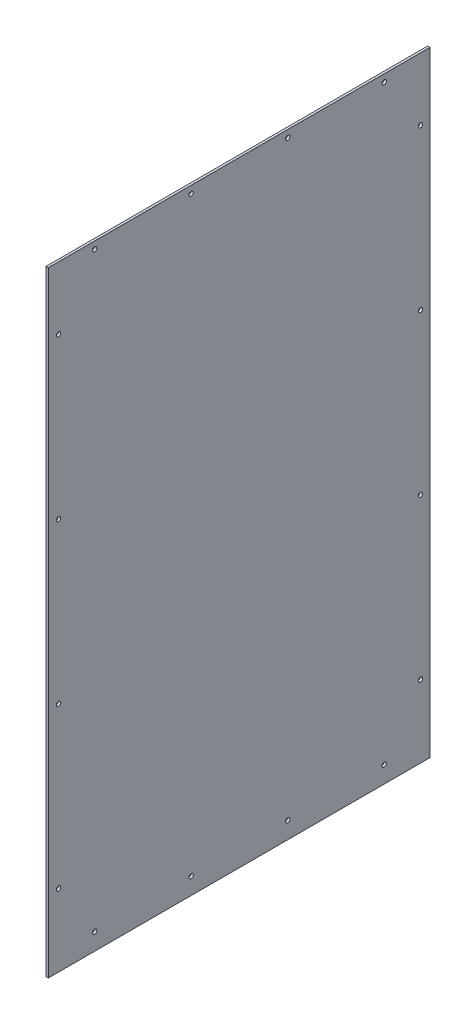
ISO-10303-21;
HEADER;
FILE_DESCRIPTION(('STEP AP214'),'2;1');
FILE_NAME('part.step','',(''),(''),'','','');
FILE_SCHEMA(('AUTOMOTIVE_DESIGN { 1 0 10303 214 1 1 1 1 }'));
ENDSEC;
DATA;
#1=APPLICATION_CONTEXT('core data for automotive mechanical design processes');
#2=APPLICATION_PROTOCOL_DEFINITION('international standard','automotive_design',2000,#1);
#3=PRODUCT_CONTEXT('',#1,'mechanical');
#4=PRODUCT('Part','Part','',(#3));
#5=PRODUCT_RELATED_PRODUCT_CATEGORY('part','',(#4));
#6=PRODUCT_DEFINITION_FORMATION('','',#4);
#7=PRODUCT_DEFINITION_CONTEXT('part definition',#1,'design');
#8=PRODUCT_DEFINITION('design','',#6,#7);
#9=PRODUCT_DEFINITION_SHAPE('','',#8);
#10=(LENGTH_UNIT() NAMED_UNIT(*) SI_UNIT(.MILLI.,.METRE.));
#11=(NAMED_UNIT(*) PLANE_ANGLE_UNIT() SI_UNIT($,.RADIAN.));
#12=(NAMED_UNIT(*) SI_UNIT($,.STERADIAN.) SOLID_ANGLE_UNIT());
#13=UNCERTAINTY_MEASURE_WITH_UNIT(LENGTH_MEASURE(1.E-05),#10,'distance_accuracy_value','');
#14=(GEOMETRIC_REPRESENTATION_CONTEXT(3) GLOBAL_UNCERTAINTY_ASSIGNED_CONTEXT((#13)) GLOBAL_UNIT_ASSIGNED_CONTEXT((#10,
#11,#12)) REPRESENTATION_CONTEXT('',''));
#15=CARTESIAN_POINT('',(0.,0.,0.));
#16=DIRECTION('',(0.,0.,1.));
#17=DIRECTION('',(1.,0.,0.));
#18=AXIS2_PLACEMENT_3D('',#15,#16,#17);
#19=CARTESIAN_POINT('',(0.,-309.5117,237.8583));
#20=DIRECTION('',(1.,0.,0.));
#21=DIRECTION('',(0.,0.,-1.));
#22=AXIS2_PLACEMENT_3D('',#19,#20,#21);
#23=CYLINDRICAL_SURFACE('',#22,2.8956);
#24=CARTESIAN_POINT('',(0.,-309.5117,237.8583));
#25=DIRECTION('',(1.,0.,0.));
#26=DIRECTION('',(0.,0.,-1.));
#27=AXIS2_PLACEMENT_3D('',#24,#25,#26);
#28=CIRCLE('',#27,2.8956);
#29=CARTESIAN_POINT('',(0.,-309.5117,234.9627));
#30=VERTEX_POINT('',#29);
#31=EDGE_CURVE('E40',#30,#30,#28,.T.);
#32=ORIENTED_EDGE('',*,*,#31,.F.);
#33=EDGE_LOOP('',(#32));
#34=FACE_BOUND('',#33,.T.);
#35=CARTESIAN_POINT('',(3.0734,-309.5117,237.8583));
#36=DIRECTION('',(1.,0.,0.));
#37=DIRECTION('',(0.,0.,-1.));
#38=AXIS2_PLACEMENT_3D('',#35,#36,#37);
#39=CIRCLE('',#38,2.8956);
#40=CARTESIAN_POINT('',(3.0734,-309.5117,234.9627));
#41=VERTEX_POINT('',#40);
#42=EDGE_CURVE('E11',#41,#41,#39,.T.);
#43=ORIENTED_EDGE('',*,*,#42,.T.);
#44=EDGE_LOOP('',(#43));
#45=FACE_BOUND('',#44,.T.);
#46=ADVANCED_FACE('F33',(#34,#45),#23,.F.);
#47=CARTESIAN_POINT('',(0.,-98.9372333333335,237.8583));
#48=DIRECTION('',(1.,0.,0.));
#49=DIRECTION('',(0.,0.,-1.));
#50=AXIS2_PLACEMENT_3D('',#47,#48,#49);
#51=CYLINDRICAL_SURFACE('',#50,2.8956);
#52=CARTESIAN_POINT('',(0.,-98.9372333333335,237.8583));
#53=DIRECTION('',(1.,0.,0.));
#54=DIRECTION('',(0.,0.,-1.));
#55=AXIS2_PLACEMENT_3D('',#52,#53,#54);
#56=CIRCLE('',#55,2.8956);
#57=CARTESIAN_POINT('',(0.,-98.9372333333335,234.9627));
#58=VERTEX_POINT('',#57);
#59=EDGE_CURVE('E294',#58,#58,#56,.T.);
#60=ORIENTED_EDGE('',*,*,#59,.F.);
#61=EDGE_LOOP('',(#60));
#62=FACE_BOUND('',#61,.T.);
#63=CARTESIAN_POINT('',(3.0734,-98.9372333333335,237.8583));
#64=DIRECTION('',(1.,0.,0.));
#65=DIRECTION('',(0.,0.,-1.));
#66=AXIS2_PLACEMENT_3D('',#63,#64,#65);
#67=CIRCLE('',#66,2.8956);
#68=CARTESIAN_POINT('',(3.0734,-98.9372333333335,234.9627));
#69=VERTEX_POINT('',#68);
#70=EDGE_CURVE('E297',#69,#69,#67,.T.);
#71=ORIENTED_EDGE('',*,*,#70,.T.);
#72=EDGE_LOOP('',(#71));
#73=FACE_BOUND('',#72,.T.);
#74=ADVANCED_FACE('F306',(#62,#73),#51,.F.);
#75=CARTESIAN_POINT('',(0.,-309.5117,-238.5949));
#76=DIRECTION('',(1.,0.,0.));
#77=DIRECTION('',(0.,0.,-1.));
#78=AXIS2_PLACEMENT_3D('',#75,#76,#77);
#79=CYLINDRICAL_SURFACE('',#78,2.8956);
#80=CARTESIAN_POINT('',(0.,-309.5117,-238.5949));
#81=DIRECTION('',(1.,0.,0.));
#82=DIRECTION('',(0.,0.,-1.));
#83=AXIS2_PLACEMENT_3D('',#80,#81,#82);
#84=CIRCLE('',#83,2.8956);
#85=CARTESIAN_POINT('',(0.,-309.5117,-241.4905));
#86=VERTEX_POINT('',#85);
#87=EDGE_CURVE('E288',#86,#86,#84,.T.);
#88=ORIENTED_EDGE('',*,*,#87,.F.);
#89=EDGE_LOOP('',(#88));
#90=FACE_BOUND('',#89,.T.);
#91=CARTESIAN_POINT('',(3.0734,-309.5117,-238.5949));
#92=DIRECTION('',(1.,0.,0.));
#93=DIRECTION('',(0.,0.,-1.));
#94=AXIS2_PLACEMENT_3D('',#91,#92,#93);
#95=CIRCLE('',#94,2.8956);
#96=CARTESIAN_POINT('',(3.0734,-309.5117,-241.4905));
#97=VERTEX_POINT('',#96);
#98=EDGE_CURVE('E291',#97,#97,#95,.T.);
#99=ORIENTED_EDGE('',*,*,#98,.T.);
#100=EDGE_LOOP('',(#99));
#101=FACE_BOUND('',#100,.T.);
#102=ADVANCED_FACE('F357',(#90,#101),#79,.F.);
#103=CARTESIAN_POINT('',(0.,-98.9372333333334,-238.5949));
#104=DIRECTION('',(1.,0.,0.));
#105=DIRECTION('',(0.,0.,-1.));
#106=AXIS2_PLACEMENT_3D('',#103,#104,#105);
#107=CYLINDRICAL_SURFACE('',#106,2.8956);
#108=CARTESIAN_POINT('',(0.,-98.9372333333334,-238.5949));
#109=DIRECTION('',(1.,0.,0.));
#110=DIRECTION('',(0.,0.,-1.));
#111=AXIS2_PLACEMENT_3D('',#108,#109,#110);
#112=CIRCLE('',#111,2.8956);
#113=CARTESIAN_POINT('',(0.,-98.9372333333334,-241.4905));
#114=VERTEX_POINT('',#113);
#115=EDGE_CURVE('E282',#114,#114,#112,.T.);
#116=ORIENTED_EDGE('',*,*,#115,.F.);
#117=EDGE_LOOP('',(#116));
#118=FACE_BOUND('',#117,.T.);
#119=CARTESIAN_POINT('',(3.0734,-98.9372333333334,-238.5949));
#120=DIRECTION('',(1.,0.,0.));
#121=DIRECTION('',(0.,0.,-1.));
#122=AXIS2_PLACEMENT_3D('',#119,#120,#121);
#123=CIRCLE('',#122,2.8956);
#124=CARTESIAN_POINT('',(3.0734,-98.9372333333334,-241.4905));
#125=VERTEX_POINT('',#124);
#126=EDGE_CURVE('E285',#125,#125,#123,.T.);
#127=ORIENTED_EDGE('',*,*,#126,.T.);
#128=EDGE_LOOP('',(#127));
#129=FACE_BOUND('',#128,.T.);
#130=ADVANCED_FACE('F353',(#118,#129),#107,.F.);
#131=CARTESIAN_POINT('',(0.,395.3383,190.2333));
#132=DIRECTION('',(1.,0.,0.));
#133=DIRECTION('',(0.,0.,-1.));
#134=AXIS2_PLACEMENT_3D('',#131,#132,#133);
#135=CYLINDRICAL_SURFACE('',#134,2.8956);
#136=CARTESIAN_POINT('',(0.,395.3383,190.2333));
#137=DIRECTION('',(1.,0.,0.));
#138=DIRECTION('',(0.,0.,-1.));
#139=AXIS2_PLACEMENT_3D('',#136,#137,#138);
#140=CIRCLE('',#139,2.8956);
#141=CARTESIAN_POINT('',(0.,395.3383,187.3377));
#142=VERTEX_POINT('',#141);
#143=EDGE_CURVE('E276',#142,#142,#140,.T.);
#144=ORIENTED_EDGE('',*,*,#143,.F.);
#145=EDGE_LOOP('',(#144));
#146=FACE_BOUND('',#145,.T.);
#147=CARTESIAN_POINT('',(3.0734,395.3383,190.2333));
#148=DIRECTION('',(1.,0.,0.));
#149=DIRECTION('',(0.,0.,-1.));
#150=AXIS2_PLACEMENT_3D('',#147,#148,#149);
#151=CIRCLE('',#150,2.8956);
#152=CARTESIAN_POINT('',(3.0734,395.3383,187.3377));
#153=VERTEX_POINT('',#152);
#154=EDGE_CURVE('E279',#153,#153,#151,.T.);
#155=ORIENTED_EDGE('',*,*,#154,.T.);
#156=EDGE_LOOP('',(#155));
#157=FACE_BOUND('',#156,.T.);
#158=ADVANCED_FACE('F349',(#146,#157),#135,.F.);
#159=CARTESIAN_POINT('',(0.,395.3383,63.1655666666666));
#160=DIRECTION('',(1.,0.,0.));
#161=DIRECTION('',(0.,0.,-1.));
#162=AXIS2_PLACEMENT_3D('',#159,#160,#161);
#163=CYLINDRICAL_SURFACE('',#162,2.8956);
#164=CARTESIAN_POINT('',(0.,395.3383,63.1655666666666));
#165=DIRECTION('',(1.,0.,0.));
#166=DIRECTION('',(0.,0.,-1.));
#167=AXIS2_PLACEMENT_3D('',#164,#165,#166);
#168=CIRCLE('',#167,2.8956);
#169=CARTESIAN_POINT('',(0.,395.3383,60.2699666666666));
#170=VERTEX_POINT('',#169);
#171=EDGE_CURVE('E270',#170,#170,#168,.T.);
#172=ORIENTED_EDGE('',*,*,#171,.F.);
#173=EDGE_LOOP('',(#172));
#174=FACE_BOUND('',#173,.T.);
#175=CARTESIAN_POINT('',(3.0734,395.3383,63.1655666666666));
#176=DIRECTION('',(1.,0.,0.));
#177=DIRECTION('',(0.,0.,-1.));
#178=AXIS2_PLACEMENT_3D('',#175,#176,#177);
#179=CIRCLE('',#178,2.8956);
#180=CARTESIAN_POINT('',(3.0734,395.3383,60.2699666666666));
#181=VERTEX_POINT('',#180);
#182=EDGE_CURVE('E273',#181,#181,#179,.T.);
#183=ORIENTED_EDGE('',*,*,#182,.T.);
#184=EDGE_LOOP('',(#183));
#185=FACE_BOUND('',#184,.T.);
#186=ADVANCED_FACE('F345',(#174,#185),#163,.F.);
#187=CARTESIAN_POINT('',(0.,-382.6383,190.2333));
#188=DIRECTION('',(1.,0.,0.));
#189=DIRECTION('',(0.,0.,-1.));
#190=AXIS2_PLACEMENT_3D('',#187,#188,#189);
#191=CYLINDRICAL_SURFACE('',#190,2.8956);
#192=CARTESIAN_POINT('',(0.,-382.6383,190.2333));
#193=DIRECTION('',(1.,0.,0.));
#194=DIRECTION('',(0.,0.,-1.));
#195=AXIS2_PLACEMENT_3D('',#192,#193,#194);
#196=CIRCLE('',#195,2.8956);
#197=CARTESIAN_POINT('',(0.,-382.6383,187.3377));
#198=VERTEX_POINT('',#197);
#199=EDGE_CURVE('E264',#198,#198,#196,.T.);
#200=ORIENTED_EDGE('',*,*,#199,.F.);
#201=EDGE_LOOP('',(#200));
#202=FACE_BOUND('',#201,.T.);
#203=CARTESIAN_POINT('',(3.0734,-382.6383,190.2333));
#204=DIRECTION('',(1.,0.,0.));
#205=DIRECTION('',(0.,0.,-1.));
#206=AXIS2_PLACEMENT_3D('',#203,#204,#205);
#207=CIRCLE('',#206,2.8956);
#208=CARTESIAN_POINT('',(3.0734,-382.6383,187.3377));
#209=VERTEX_POINT('',#208);
#210=EDGE_CURVE('E267',#209,#209,#207,.T.);
#211=ORIENTED_EDGE('',*,*,#210,.T.);
#212=EDGE_LOOP('',(#211));
#213=FACE_BOUND('',#212,.T.);
#214=ADVANCED_FACE('F341',(#202,#213),#191,.F.);
#215=CARTESIAN_POINT('',(0.,-382.6383,63.1655666666665));
#216=DIRECTION('',(1.,0.,0.));
#217=DIRECTION('',(0.,0.,-1.));
#218=AXIS2_PLACEMENT_3D('',#215,#216,#217);
#219=CYLINDRICAL_SURFACE('',#218,2.8956);
#220=CARTESIAN_POINT('',(0.,-382.6383,63.1655666666665));
#221=DIRECTION('',(1.,0.,0.));
#222=DIRECTION('',(0.,0.,-1.));
#223=AXIS2_PLACEMENT_3D('',#220,#221,#222);
#224=CIRCLE('',#223,2.8956);
#225=CARTESIAN_POINT('',(0.,-382.6383,60.2699666666665));
#226=VERTEX_POINT('',#225);
#227=EDGE_CURVE('E258',#226,#226,#224,.T.);
#228=ORIENTED_EDGE('',*,*,#227,.F.);
#229=EDGE_LOOP('',(#228));
#230=FACE_BOUND('',#229,.T.);
#231=CARTESIAN_POINT('',(3.0734,-382.6383,63.1655666666665));
#232=DIRECTION('',(1.,0.,0.));
#233=DIRECTION('',(0.,0.,-1.));
#234=AXIS2_PLACEMENT_3D('',#231,#232,#233);
#235=CIRCLE('',#234,2.8956);
#236=CARTESIAN_POINT('',(3.0734,-382.6383,60.2699666666665));
#237=VERTEX_POINT('',#236);
#238=EDGE_CURVE('E261',#237,#237,#235,.T.);
#239=ORIENTED_EDGE('',*,*,#238,.T.);
#240=EDGE_LOOP('',(#239));
#241=FACE_BOUND('',#240,.T.);
#242=ADVANCED_FACE('F337',(#230,#241),#219,.F.);
#243=CARTESIAN_POINT('',(3.0734,-404.8633,251.1933));
#244=DIRECTION('',(0.,0.,-1.));
#245=DIRECTION('',(-1.,0.,0.));
#246=AXIS2_PLACEMENT_3D('',#243,#244,#245);
#247=PLANE('',#246);
#248=DIRECTION('',(0.,-1.,0.));
#249=VECTOR('',#248,1.);
#250=CARTESIAN_POINT('',(0.,-404.8633,251.1933));
#251=LINE('',#250,#249);
#252=CARTESIAN_POINT('',(0.,404.8633,251.1933));
#253=VERTEX_POINT('',#252);
#254=CARTESIAN_POINT('',(0.,-404.8633,251.1933));
#255=VERTEX_POINT('',#254);
#256=EDGE_CURVE('E233',#253,#255,#251,.T.);
#257=ORIENTED_EDGE('',*,*,#256,.T.);
#258=DIRECTION('',(-1.,0.,0.));
#259=VECTOR('',#258,1.);
#260=CARTESIAN_POINT('',(3.0734,-404.8633,251.1933));
#261=LINE('',#260,#259);
#262=CARTESIAN_POINT('',(3.0734,-404.8633,251.1933));
#263=VERTEX_POINT('',#262);
#264=EDGE_CURVE('E256',#263,#255,#261,.T.);
#265=ORIENTED_EDGE('',*,*,#264,.F.);
#266=DIRECTION('',(0.,-1.,0.));
#267=VECTOR('',#266,1.);
#268=CARTESIAN_POINT('',(3.0734,-404.8633,251.1933));
#269=LINE('',#268,#267);
#270=CARTESIAN_POINT('',(3.0734,404.8633,251.1933));
#271=VERTEX_POINT('',#270);
#272=EDGE_CURVE('E236',#271,#263,#269,.T.);
#273=ORIENTED_EDGE('',*,*,#272,.F.);
#274=DIRECTION('',(-1.,0.,0.));
#275=VECTOR('',#274,1.);
#276=CARTESIAN_POINT('',(3.0734,404.8633,251.1933));
#277=LINE('',#276,#275);
#278=EDGE_CURVE('E242',#271,#253,#277,.T.);
#279=ORIENTED_EDGE('',*,*,#278,.T.);
#280=EDGE_LOOP('',(#257,#265,#273,#279));
#281=FACE_BOUND('',#280,.T.);
#282=ADVANCED_FACE('F334',(#281),#247,.F.);
#283=CARTESIAN_POINT('',(3.0734,-404.8633,-251.1933));
#284=DIRECTION('',(0.,1.,0.));
#285=DIRECTION('',(0.,0.,1.));
#286=AXIS2_PLACEMENT_3D('',#283,#284,#285);
#287=PLANE('',#286);
#288=DIRECTION('',(0.,0.,-1.));
#289=VECTOR('',#288,1.);
#290=CARTESIAN_POINT('',(0.,-404.8633,-251.1933));
#291=LINE('',#290,#289);
#292=CARTESIAN_POINT('',(0.,-404.8633,-251.1933));
#293=VERTEX_POINT('',#292);
#294=EDGE_CURVE('E245',#255,#293,#291,.T.);
#295=ORIENTED_EDGE('',*,*,#294,.T.);
#296=DIRECTION('',(-1.,0.,0.));
#297=VECTOR('',#296,1.);
#298=CARTESIAN_POINT('',(3.0734,-404.8633,-251.1933));
#299=LINE('',#298,#297);
#300=CARTESIAN_POINT('',(3.0734,-404.8633,-251.1933));
#301=VERTEX_POINT('',#300);
#302=EDGE_CURVE('E253',#301,#293,#299,.T.);
#303=ORIENTED_EDGE('',*,*,#302,.F.);
#304=DIRECTION('',(0.,0.,-1.));
#305=VECTOR('',#304,1.);
#306=CARTESIAN_POINT('',(3.0734,-404.8633,-251.1933));
#307=LINE('',#306,#305);
#308=EDGE_CURVE('E85',#263,#301,#307,.T.);
#309=ORIENTED_EDGE('',*,*,#308,.F.);
#310=ORIENTED_EDGE('',*,*,#264,.T.);
#311=EDGE_LOOP('',(#295,#303,#309,#310));
#312=FACE_BOUND('',#311,.T.);
#313=ADVANCED_FACE('F330',(#312),#287,.F.);
#314=CARTESIAN_POINT('',(3.0734,-404.8633,-251.1933));
#315=DIRECTION('',(0.,0.,1.));
#316=DIRECTION('',(1.,0.,0.));
#317=AXIS2_PLACEMENT_3D('',#314,#315,#316);
#318=PLANE('',#317);
#319=DIRECTION('',(0.,1.,0.));
#320=VECTOR('',#319,1.);
#321=CARTESIAN_POINT('',(0.,-404.8633,-251.1933));
#322=LINE('',#321,#320);
#323=CARTESIAN_POINT('',(0.,404.8633,-251.1933));
#324=VERTEX_POINT('',#323);
#325=EDGE_CURVE('E247',#293,#324,#322,.T.);
#326=ORIENTED_EDGE('',*,*,#325,.T.);
#327=DIRECTION('',(-1.,0.,0.));
#328=VECTOR('',#327,1.);
#329=CARTESIAN_POINT('',(3.0734,404.8633,-251.1933));
#330=LINE('',#329,#328);
#331=CARTESIAN_POINT('',(3.0734,404.8633,-251.1933));
#332=VERTEX_POINT('',#331);
#333=EDGE_CURVE('E251',#332,#324,#330,.T.);
#334=ORIENTED_EDGE('',*,*,#333,.F.);
#335=DIRECTION('',(0.,1.,0.));
#336=VECTOR('',#335,1.);
#337=CARTESIAN_POINT('',(3.0734,-404.8633,-251.1933));
#338=LINE('',#337,#336);
#339=EDGE_CURVE('E239',#301,#332,#338,.T.);
#340=ORIENTED_EDGE('',*,*,#339,.F.);
#341=ORIENTED_EDGE('',*,*,#302,.T.);
#342=EDGE_LOOP('',(#326,#334,#340,#341));
#343=FACE_BOUND('',#342,.T.);
#344=ADVANCED_FACE('F321',(#343),#318,.F.);
#345=CARTESIAN_POINT('',(3.0734,404.8633,-251.1933));
#346=DIRECTION('',(0.,-1.,0.));
#347=DIRECTION('',(0.,0.,-1.));
#348=AXIS2_PLACEMENT_3D('',#345,#346,#347);
#349=PLANE('',#348);
#350=DIRECTION('',(0.,0.,1.));
#351=VECTOR('',#350,1.);
#352=CARTESIAN_POINT('',(0.,404.8633,-251.1933));
#353=LINE('',#352,#351);
#354=EDGE_CURVE('E77',#324,#253,#353,.T.);
#355=ORIENTED_EDGE('',*,*,#354,.T.);
#356=ORIENTED_EDGE('',*,*,#278,.F.);
#357=DIRECTION('',(0.,0.,1.));
#358=VECTOR('',#357,1.);
#359=CARTESIAN_POINT('',(3.0734,404.8633,-251.1933));
#360=LINE('',#359,#358);
#361=EDGE_CURVE('E56',#332,#271,#360,.T.);
#362=ORIENTED_EDGE('',*,*,#361,.F.);
#363=ORIENTED_EDGE('',*,*,#333,.T.);
#364=EDGE_LOOP('',(#355,#356,#362,#363));
#365=FACE_BOUND('',#364,.T.);
#366=ADVANCED_FACE('F311',(#365),#349,.F.);
#367=CARTESIAN_POINT('',(3.0734,0.,0.));
#368=DIRECTION('',(1.,0.,0.));
#369=DIRECTION('',(0.,0.,-1.));
#370=AXIS2_PLACEMENT_3D('',#367,#368,#369);
#371=PLANE('',#370);
#372=CARTESIAN_POINT('',(3.0734,111.637233333333,237.8583));
#373=DIRECTION('',(1.,0.,0.));
#374=DIRECTION('',(0.,0.,-1.));
#375=AXIS2_PLACEMENT_3D('',#372,#373,#374);
#376=CIRCLE('',#375,2.8956);
#377=CARTESIAN_POINT('',(3.0734,111.637233333333,234.9627));
#378=VERTEX_POINT('',#377);
#379=EDGE_CURVE('E190',#378,#378,#376,.T.);
#380=ORIENTED_EDGE('',*,*,#379,.F.);
#381=EDGE_LOOP('',(#380));
#382=FACE_BOUND('',#381,.T.);
#383=CARTESIAN_POINT('',(3.0734,111.637233333333,-238.5949));
#384=DIRECTION('',(1.,0.,0.));
#385=DIRECTION('',(0.,0.,-1.));
#386=AXIS2_PLACEMENT_3D('',#383,#384,#385);
#387=CIRCLE('',#386,2.8956);
#388=CARTESIAN_POINT('',(3.0734,111.637233333333,-241.4905));
#389=VERTEX_POINT('',#388);
#390=EDGE_CURVE('E196',#389,#389,#387,.T.);
#391=ORIENTED_EDGE('',*,*,#390,.F.);
#392=EDGE_LOOP('',(#391));
#393=FACE_BOUND('',#392,.T.);
#394=CARTESIAN_POINT('',(3.0734,322.2117,-238.5949));
#395=DIRECTION('',(1.,0.,0.));
#396=DIRECTION('',(0.,0.,-1.));
#397=AXIS2_PLACEMENT_3D('',#394,#395,#396);
#398=CIRCLE('',#397,2.8956);
#399=CARTESIAN_POINT('',(3.0734,322.2117,-241.4905));
#400=VERTEX_POINT('',#399);
#401=EDGE_CURVE('E199',#400,#400,#398,.T.);
#402=ORIENTED_EDGE('',*,*,#401,.F.);
#403=EDGE_LOOP('',(#402));
#404=FACE_BOUND('',#403,.T.);
#405=CARTESIAN_POINT('',(3.0734,322.2117,237.8583));
#406=DIRECTION('',(1.,0.,0.));
#407=DIRECTION('',(0.,0.,-1.));
#408=AXIS2_PLACEMENT_3D('',#405,#406,#407);
#409=CIRCLE('',#408,2.8956);
#410=CARTESIAN_POINT('',(3.0734,322.2117,234.9627));
#411=VERTEX_POINT('',#410);
#412=EDGE_CURVE('E203',#411,#411,#409,.T.);
#413=ORIENTED_EDGE('',*,*,#412,.F.);
#414=EDGE_LOOP('',(#413));
#415=FACE_BOUND('',#414,.T.);
#416=CARTESIAN_POINT('',(3.0734,395.3383,-63.9021666666668));
#417=DIRECTION('',(1.,0.,0.));
#418=DIRECTION('',(0.,0.,-1.));
#419=AXIS2_PLACEMENT_3D('',#416,#417,#418);
#420=CIRCLE('',#419,2.8956);
#421=CARTESIAN_POINT('',(3.0734,395.3383,-66.7977666666668));
#422=VERTEX_POINT('',#421);
#423=EDGE_CURVE('E214',#422,#422,#420,.T.);
#424=ORIENTED_EDGE('',*,*,#423,.F.);
#425=EDGE_LOOP('',(#424));
#426=FACE_BOUND('',#425,.T.);
#427=CARTESIAN_POINT('',(3.0734,-382.6383,-63.9021666666668));
#428=DIRECTION('',(1.,0.,0.));
#429=DIRECTION('',(0.,0.,-1.));
#430=AXIS2_PLACEMENT_3D('',#427,#428,#429);
#431=CIRCLE('',#430,2.8956);
#432=CARTESIAN_POINT('',(3.0734,-382.6383,-66.7977666666668));
#433=VERTEX_POINT('',#432);
#434=EDGE_CURVE('E220',#433,#433,#431,.T.);
#435=ORIENTED_EDGE('',*,*,#434,.F.);
#436=EDGE_LOOP('',(#435));
#437=FACE_BOUND('',#436,.T.);
#438=CARTESIAN_POINT('',(3.0734,-382.6383,-190.9699));
#439=DIRECTION('',(1.,0.,0.));
#440=DIRECTION('',(0.,0.,-1.));
#441=AXIS2_PLACEMENT_3D('',#438,#439,#440);
#442=CIRCLE('',#441,2.8956);
#443=CARTESIAN_POINT('',(3.0734,-382.6383,-193.8655));
#444=VERTEX_POINT('',#443);
#445=EDGE_CURVE('E223',#444,#444,#442,.T.);
#446=ORIENTED_EDGE('',*,*,#445,.F.);
#447=EDGE_LOOP('',(#446));
#448=FACE_BOUND('',#447,.T.);
#449=CARTESIAN_POINT('',(3.0734,395.3383,-190.9699));
#450=DIRECTION('',(1.,0.,0.));
#451=DIRECTION('',(0.,0.,-1.));
#452=AXIS2_PLACEMENT_3D('',#449,#450,#451);
#453=CIRCLE('',#452,2.8956);
#454=CARTESIAN_POINT('',(3.0734,395.3383,-193.8655));
#455=VERTEX_POINT('',#454);
#456=EDGE_CURVE('E227',#455,#455,#453,.T.);
#457=ORIENTED_EDGE('',*,*,#456,.F.);
#458=EDGE_LOOP('',(#457));
#459=FACE_BOUND('',#458,.T.);
#460=ORIENTED_EDGE('',*,*,#272,.T.);
#461=ORIENTED_EDGE('',*,*,#308,.T.);
#462=ORIENTED_EDGE('',*,*,#339,.T.);
#463=ORIENTED_EDGE('',*,*,#361,.T.);
#464=EDGE_LOOP('',(#460,#461,#462,#463));
#465=FACE_BOUND('',#464,.T.);
#466=ORIENTED_EDGE('',*,*,#238,.F.);
#467=EDGE_LOOP('',(#466));
#468=FACE_BOUND('',#467,.T.);
#469=ORIENTED_EDGE('',*,*,#210,.F.);
#470=EDGE_LOOP('',(#469));
#471=FACE_BOUND('',#470,.T.);
#472=ORIENTED_EDGE('',*,*,#182,.F.);
#473=EDGE_LOOP('',(#472));
#474=FACE_BOUND('',#473,.T.);
#475=ORIENTED_EDGE('',*,*,#154,.F.);
#476=EDGE_LOOP('',(#475));
#477=FACE_BOUND('',#476,.T.);
#478=ORIENTED_EDGE('',*,*,#126,.F.);
#479=EDGE_LOOP('',(#478));
#480=FACE_BOUND('',#479,.T.);
#481=ORIENTED_EDGE('',*,*,#98,.F.);
#482=EDGE_LOOP('',(#481));
#483=FACE_BOUND('',#482,.T.);
#484=ORIENTED_EDGE('',*,*,#70,.F.);
#485=EDGE_LOOP('',(#484));
#486=FACE_BOUND('',#485,.T.);
#487=ORIENTED_EDGE('',*,*,#42,.F.);
#488=EDGE_LOOP('',(#487));
#489=FACE_BOUND('',#488,.T.);
#490=ADVANCED_FACE('F309',(#382,#393,#404,#415,#426,#437,#448,#459,#465,#468,#471,#474,#477,
#480,#483,#486,#489),#371,.T.);
#491=CARTESIAN_POINT('',(0.,0.,0.));
#492=DIRECTION('',(1.,0.,0.));
#493=DIRECTION('',(0.,0.,-1.));
#494=AXIS2_PLACEMENT_3D('',#491,#492,#493);
#495=PLANE('',#494);
#496=DIRECTION('',(0.,0.,1.));
#497=VECTOR('',#496,1.);
#498=CARTESIAN_POINT('',(0.,-384.2639,-238.25754307231));
#499=LINE('',#498,#497);
#500=CARTESIAN_POINT('',(0.,-384.2639,-238.25754307231));
#501=VERTEX_POINT('',#500);
#502=CARTESIAN_POINT('',(0.,-384.2639,-237.74954307231));
#503=VERTEX_POINT('',#502);
#504=EDGE_CURVE('E163',#501,#503,#499,.T.);
#505=ORIENTED_EDGE('',*,*,#504,.F.);
#506=DIRECTION('',(0.,1.,0.));
#507=VECTOR('',#506,1.);
#508=CARTESIAN_POINT('',(0.,-385.5339,-238.25754307231));
#509=LINE('',#508,#507);
#510=CARTESIAN_POINT('',(0.,-385.5339,-238.25754307231));
#511=VERTEX_POINT('',#510);
#512=EDGE_CURVE('E47',#511,#501,#509,.T.);
#513=ORIENTED_EDGE('',*,*,#512,.F.);
#514=DIRECTION('',(0.,0.,1.));
#515=VECTOR('',#514,1.);
#516=CARTESIAN_POINT('',(0.,-385.5339,-238.25754307231));
#517=LINE('',#516,#515);
#518=CARTESIAN_POINT('',(0.,-385.5339,-239.27354307231));
#519=VERTEX_POINT('',#518);
#520=EDGE_CURVE('E146',#519,#511,#517,.T.);
#521=ORIENTED_EDGE('',*,*,#520,.F.);
#522=DIRECTION('',(0.,-1.,0.));
#523=VECTOR('',#522,1.);
#524=CARTESIAN_POINT('',(0.,-385.5339,-239.27354307231));
#525=LINE('',#524,#523);
#526=CARTESIAN_POINT('',(0.,-384.2639,-239.27354307231));
#527=VERTEX_POINT('',#526);
#528=EDGE_CURVE('E149',#527,#519,#525,.T.);
#529=ORIENTED_EDGE('',*,*,#528,.F.);
#530=DIRECTION('',(0.,0.,1.));
#531=VECTOR('',#530,1.);
#532=CARTESIAN_POINT('',(0.,-384.2639,-239.27354307231));
#533=LINE('',#532,#531);
#534=CARTESIAN_POINT('',(0.,-384.2639,-239.78154307231));
#535=VERTEX_POINT('',#534);
#536=EDGE_CURVE('E171',#535,#527,#533,.T.);
#537=ORIENTED_EDGE('',*,*,#536,.F.);
#538=DIRECTION('',(0.,-0.780868809443032,-0.624695047554422));
#539=VECTOR('',#538,1.);
#540=CARTESIAN_POINT('',(0.,-384.2639,-239.78154307231));
#541=LINE('',#540,#539);
#542=CARTESIAN_POINT('',(0.,-382.9939,-238.76554307231));
#543=VERTEX_POINT('',#542);
#544=EDGE_CURVE('E168',#543,#535,#541,.T.);
#545=ORIENTED_EDGE('',*,*,#544,.F.);
#546=DIRECTION('',(0.,0.780868809443015,-0.624695047554443));
#547=VECTOR('',#546,1.);
#548=CARTESIAN_POINT('',(0.,-384.2639,-237.74954307231));
#549=LINE('',#548,#547);
#550=EDGE_CURVE('E165',#503,#543,#549,.T.);
#551=ORIENTED_EDGE('',*,*,#550,.F.);
#552=EDGE_LOOP('',(#505,#513,#521,#529,#537,#545,#551));
#553=FACE_BOUND('',#552,.T.);
#554=CARTESIAN_POINT('',(0.,111.637233333333,237.8583));
#555=DIRECTION('',(1.,0.,0.));
#556=DIRECTION('',(0.,0.,-1.));
#557=AXIS2_PLACEMENT_3D('',#554,#555,#556);
#558=CIRCLE('',#557,2.8956);
#559=CARTESIAN_POINT('',(0.,111.637233333333,234.9627));
#560=VERTEX_POINT('',#559);
#561=EDGE_CURVE('E178',#560,#560,#558,.T.);
#562=ORIENTED_EDGE('',*,*,#561,.T.);
#563=EDGE_LOOP('',(#562));
#564=FACE_BOUND('',#563,.T.);
#565=CARTESIAN_POINT('',(0.,111.637233333333,-238.5949));
#566=DIRECTION('',(1.,0.,0.));
#567=DIRECTION('',(0.,0.,-1.));
#568=AXIS2_PLACEMENT_3D('',#565,#566,#567);
#569=CIRCLE('',#568,2.8956);
#570=CARTESIAN_POINT('',(0.,111.637233333333,-241.4905));
#571=VERTEX_POINT('',#570);
#572=EDGE_CURVE('E193',#571,#571,#569,.T.);
#573=ORIENTED_EDGE('',*,*,#572,.T.);
#574=EDGE_LOOP('',(#573));
#575=FACE_BOUND('',#574,.T.);
#576=CARTESIAN_POINT('',(0.,322.2117,-238.5949));
#577=DIRECTION('',(1.,0.,0.));
#578=DIRECTION('',(0.,0.,-1.));
#579=AXIS2_PLACEMENT_3D('',#576,#577,#578);
#580=CIRCLE('',#579,2.8956);
#581=CARTESIAN_POINT('',(0.,322.2117,-241.4905));
#582=VERTEX_POINT('',#581);
#583=EDGE_CURVE('E200',#582,#582,#580,.T.);
#584=ORIENTED_EDGE('',*,*,#583,.T.);
#585=EDGE_LOOP('',(#584));
#586=FACE_BOUND('',#585,.T.);
#587=CARTESIAN_POINT('',(0.,322.2117,237.8583));
#588=DIRECTION('',(1.,0.,0.));
#589=DIRECTION('',(0.,0.,-1.));
#590=AXIS2_PLACEMENT_3D('',#587,#588,#589);
#591=CIRCLE('',#590,2.8956);
#592=CARTESIAN_POINT('',(0.,322.2117,234.9627));
#593=VERTEX_POINT('',#592);
#594=EDGE_CURVE('E206',#593,#593,#591,.T.);
#595=ORIENTED_EDGE('',*,*,#594,.T.);
#596=EDGE_LOOP('',(#595));
#597=FACE_BOUND('',#596,.T.);
#598=CARTESIAN_POINT('',(0.,395.3383,-63.9021666666668));
#599=DIRECTION('',(1.,0.,0.));
#600=DIRECTION('',(0.,0.,-1.));
#601=AXIS2_PLACEMENT_3D('',#598,#599,#600);
#602=CIRCLE('',#601,2.8956);
#603=CARTESIAN_POINT('',(0.,395.3383,-66.7977666666668));
#604=VERTEX_POINT('',#603);
#605=EDGE_CURVE('E209',#604,#604,#602,.T.);
#606=ORIENTED_EDGE('',*,*,#605,.T.);
#607=EDGE_LOOP('',(#606));
#608=FACE_BOUND('',#607,.T.);
#609=CARTESIAN_POINT('',(0.,-382.6383,-63.9021666666668));
#610=DIRECTION('',(1.,0.,0.));
#611=DIRECTION('',(0.,0.,-1.));
#612=AXIS2_PLACEMENT_3D('',#609,#610,#611);
#613=CIRCLE('',#612,2.8956);
#614=CARTESIAN_POINT('',(0.,-382.6383,-66.7977666666668));
#615=VERTEX_POINT('',#614);
#616=EDGE_CURVE('E217',#615,#615,#613,.T.);
#617=ORIENTED_EDGE('',*,*,#616,.T.);
#618=EDGE_LOOP('',(#617));
#619=FACE_BOUND('',#618,.T.);
#620=CARTESIAN_POINT('',(0.,-382.6383,-190.9699));
#621=DIRECTION('',(1.,0.,0.));
#622=DIRECTION('',(0.,0.,-1.));
#623=AXIS2_PLACEMENT_3D('',#620,#621,#622);
#624=CIRCLE('',#623,2.8956);
#625=CARTESIAN_POINT('',(0.,-382.6383,-193.8655));
#626=VERTEX_POINT('',#625);
#627=EDGE_CURVE('E224',#626,#626,#624,.T.);
#628=ORIENTED_EDGE('',*,*,#627,.T.);
#629=EDGE_LOOP('',(#628));
#630=FACE_BOUND('',#629,.T.);
#631=CARTESIAN_POINT('',(0.,395.3383,-190.9699));
#632=DIRECTION('',(1.,0.,0.));
#633=DIRECTION('',(0.,0.,-1.));
#634=AXIS2_PLACEMENT_3D('',#631,#632,#633);
#635=CIRCLE('',#634,2.8956);
#636=CARTESIAN_POINT('',(0.,395.3383,-193.8655));
#637=VERTEX_POINT('',#636);
#638=EDGE_CURVE('E230',#637,#637,#635,.T.);
#639=ORIENTED_EDGE('',*,*,#638,.T.);
#640=EDGE_LOOP('',(#639));
#641=FACE_BOUND('',#640,.T.);
#642=ORIENTED_EDGE('',*,*,#256,.F.);
#643=ORIENTED_EDGE('',*,*,#354,.F.);
#644=ORIENTED_EDGE('',*,*,#325,.F.);
#645=ORIENTED_EDGE('',*,*,#294,.F.);
#646=EDGE_LOOP('',(#642,#643,#644,#645));
#647=FACE_BOUND('',#646,.T.);
#648=ORIENTED_EDGE('',*,*,#227,.T.);
#649=EDGE_LOOP('',(#648));
#650=FACE_BOUND('',#649,.T.);
#651=ORIENTED_EDGE('',*,*,#199,.T.);
#652=EDGE_LOOP('',(#651));
#653=FACE_BOUND('',#652,.T.);
#654=ORIENTED_EDGE('',*,*,#171,.T.);
#655=EDGE_LOOP('',(#654));
#656=FACE_BOUND('',#655,.T.);
#657=ORIENTED_EDGE('',*,*,#143,.T.);
#658=EDGE_LOOP('',(#657));
#659=FACE_BOUND('',#658,.T.);
#660=ORIENTED_EDGE('',*,*,#115,.T.);
#661=EDGE_LOOP('',(#660));
#662=FACE_BOUND('',#661,.T.);
#663=ORIENTED_EDGE('',*,*,#87,.T.);
#664=EDGE_LOOP('',(#663));
#665=FACE_BOUND('',#664,.T.);
#666=ORIENTED_EDGE('',*,*,#59,.T.);
#667=EDGE_LOOP('',(#666));
#668=FACE_BOUND('',#667,.T.);
#669=ORIENTED_EDGE('',*,*,#31,.T.);
#670=EDGE_LOOP('',(#669));
#671=FACE_BOUND('',#670,.T.);
#672=ADVANCED_FACE('F302',(#553,#564,#575,#586,#597,#608,#619,#630,#641,#647,#650,#653,#656,
#659,#662,#665,#668,#671),#495,.F.);
#673=CARTESIAN_POINT('',(0.,395.3383,-190.9699));
#674=DIRECTION('',(1.,0.,0.));
#675=DIRECTION('',(0.,0.,-1.));
#676=AXIS2_PLACEMENT_3D('',#673,#674,#675);
#677=CYLINDRICAL_SURFACE('',#676,2.8956);
#678=ORIENTED_EDGE('',*,*,#638,.F.);
#679=EDGE_LOOP('',(#678));
#680=FACE_BOUND('',#679,.T.);
#681=ORIENTED_EDGE('',*,*,#456,.T.);
#682=EDGE_LOOP('',(#681));
#683=FACE_BOUND('',#682,.T.);
#684=ADVANCED_FACE('F318',(#680,#683),#677,.F.);
#685=CARTESIAN_POINT('',(0.,-382.6383,-190.9699));
#686=DIRECTION('',(1.,0.,0.));
#687=DIRECTION('',(0.,0.,-1.));
#688=AXIS2_PLACEMENT_3D('',#685,#686,#687);
#689=CYLINDRICAL_SURFACE('',#688,2.8956);
#690=ORIENTED_EDGE('',*,*,#627,.F.);
#691=EDGE_LOOP('',(#690));
#692=FACE_BOUND('',#691,.T.);
#693=ORIENTED_EDGE('',*,*,#445,.T.);
#694=EDGE_LOOP('',(#693));
#695=FACE_BOUND('',#694,.T.);
#696=ADVANCED_FACE('F423',(#692,#695),#689,.F.);
#697=CARTESIAN_POINT('',(0.,-382.6383,-63.9021666666668));
#698=DIRECTION('',(1.,0.,0.));
#699=DIRECTION('',(0.,0.,-1.));
#700=AXIS2_PLACEMENT_3D('',#697,#698,#699);
#701=CYLINDRICAL_SURFACE('',#700,2.8956);
#702=ORIENTED_EDGE('',*,*,#616,.F.);
#703=EDGE_LOOP('',(#702));
#704=FACE_BOUND('',#703,.T.);
#705=ORIENTED_EDGE('',*,*,#434,.T.);
#706=EDGE_LOOP('',(#705));
#707=FACE_BOUND('',#706,.T.);
#708=ADVANCED_FACE('F432',(#704,#707),#701,.F.);
#709=CARTESIAN_POINT('',(0.,395.3383,-63.9021666666668));
#710=DIRECTION('',(1.,0.,0.));
#711=DIRECTION('',(0.,0.,-1.));
#712=AXIS2_PLACEMENT_3D('',#709,#710,#711);
#713=CYLINDRICAL_SURFACE('',#712,2.8956);
#714=ORIENTED_EDGE('',*,*,#605,.F.);
#715=EDGE_LOOP('',(#714));
#716=FACE_BOUND('',#715,.T.);
#717=ORIENTED_EDGE('',*,*,#423,.T.);
#718=EDGE_LOOP('',(#717));
#719=FACE_BOUND('',#718,.T.);
#720=ADVANCED_FACE('F440',(#716,#719),#713,.F.);
#721=CARTESIAN_POINT('',(0.,322.2117,237.8583));
#722=DIRECTION('',(1.,0.,0.));
#723=DIRECTION('',(0.,0.,-1.));
#724=AXIS2_PLACEMENT_3D('',#721,#722,#723);
#725=CYLINDRICAL_SURFACE('',#724,2.8956);
#726=ORIENTED_EDGE('',*,*,#594,.F.);
#727=EDGE_LOOP('',(#726));
#728=FACE_BOUND('',#727,.T.);
#729=ORIENTED_EDGE('',*,*,#412,.T.);
#730=EDGE_LOOP('',(#729));
#731=FACE_BOUND('',#730,.T.);
#732=ADVANCED_FACE('F448',(#728,#731),#725,.F.);
#733=CARTESIAN_POINT('',(0.,322.2117,-238.5949));
#734=DIRECTION('',(1.,0.,0.));
#735=DIRECTION('',(0.,0.,-1.));
#736=AXIS2_PLACEMENT_3D('',#733,#734,#735);
#737=CYLINDRICAL_SURFACE('',#736,2.8956);
#738=ORIENTED_EDGE('',*,*,#583,.F.);
#739=EDGE_LOOP('',(#738));
#740=FACE_BOUND('',#739,.T.);
#741=ORIENTED_EDGE('',*,*,#401,.T.);
#742=EDGE_LOOP('',(#741));
#743=FACE_BOUND('',#742,.T.);
#744=ADVANCED_FACE('F456',(#740,#743),#737,.F.);
#745=CARTESIAN_POINT('',(0.,111.637233333333,-238.5949));
#746=DIRECTION('',(1.,0.,0.));
#747=DIRECTION('',(0.,0.,-1.));
#748=AXIS2_PLACEMENT_3D('',#745,#746,#747);
#749=CYLINDRICAL_SURFACE('',#748,2.8956);
#750=ORIENTED_EDGE('',*,*,#572,.F.);
#751=EDGE_LOOP('',(#750));
#752=FACE_BOUND('',#751,.T.);
#753=ORIENTED_EDGE('',*,*,#390,.T.);
#754=EDGE_LOOP('',(#753));
#755=FACE_BOUND('',#754,.T.);
#756=ADVANCED_FACE('F464',(#752,#755),#749,.F.);
#757=CARTESIAN_POINT('',(0.,111.637233333333,237.8583));
#758=DIRECTION('',(1.,0.,0.));
#759=DIRECTION('',(0.,0.,-1.));
#760=AXIS2_PLACEMENT_3D('',#757,#758,#759);
#761=CYLINDRICAL_SURFACE('',#760,2.8956);
#762=ORIENTED_EDGE('',*,*,#561,.F.);
#763=EDGE_LOOP('',(#762));
#764=FACE_BOUND('',#763,.T.);
#765=ORIENTED_EDGE('',*,*,#379,.T.);
#766=EDGE_LOOP('',(#765));
#767=FACE_BOUND('',#766,.T.);
#768=ADVANCED_FACE('F472',(#764,#767),#761,.F.);
#769=CARTESIAN_POINT('',(2.54,-385.5339,-238.25754307231));
#770=DIRECTION('',(0.,0.,1.));
#771=DIRECTION('',(1.,0.,0.));
#772=AXIS2_PLACEMENT_3D('',#769,#770,#771);
#773=PLANE('',#772);
#774=ORIENTED_EDGE('',*,*,#512,.T.);
#775=DIRECTION('',(-1.,0.,0.));
#776=VECTOR('',#775,1.);
#777=CARTESIAN_POINT('',(2.54,-384.2639,-238.25754307231));
#778=LINE('',#777,#776);
#779=CARTESIAN_POINT('',(2.54,-384.2639,-238.25754307231));
#780=VERTEX_POINT('',#779);
#781=EDGE_CURVE('E123',#780,#501,#778,.T.);
#782=ORIENTED_EDGE('',*,*,#781,.F.);
#783=DIRECTION('',(0.,1.,0.));
#784=VECTOR('',#783,1.);
#785=CARTESIAN_POINT('',(2.54,-385.5339,-238.25754307231));
#786=LINE('',#785,#784);
#787=CARTESIAN_POINT('',(2.54,-385.5339,-238.25754307231));
#788=VERTEX_POINT('',#787);
#789=EDGE_CURVE('E127',#788,#780,#786,.T.);
#790=ORIENTED_EDGE('',*,*,#789,.F.);
#791=DIRECTION('',(-1.,0.,0.));
#792=VECTOR('',#791,1.);
#793=CARTESIAN_POINT('',(2.54,-385.5339,-238.25754307231));
#794=LINE('',#793,#792);
#795=EDGE_CURVE('E176',#788,#511,#794,.T.);
#796=ORIENTED_EDGE('',*,*,#795,.T.);
#797=EDGE_LOOP('',(#774,#782,#790,#796));
#798=FACE_BOUND('',#797,.T.);
#799=ADVANCED_FACE('F125',(#798),#773,.F.);
#800=CARTESIAN_POINT('',(2.54,-385.5339,-238.25754307231));
#801=DIRECTION('',(0.,-1.,0.));
#802=DIRECTION('',(0.,0.,-1.));
#803=AXIS2_PLACEMENT_3D('',#800,#801,#802);
#804=PLANE('',#803);
#805=ORIENTED_EDGE('',*,*,#520,.T.);
#806=ORIENTED_EDGE('',*,*,#795,.F.);
#807=DIRECTION('',(0.,0.,1.));
#808=VECTOR('',#807,1.);
#809=CARTESIAN_POINT('',(2.54,-385.5339,-238.25754307231));
#810=LINE('',#809,#808);
#811=CARTESIAN_POINT('',(2.54,-385.5339,-239.27354307231));
#812=VERTEX_POINT('',#811);
#813=EDGE_CURVE('E133',#812,#788,#810,.T.);
#814=ORIENTED_EDGE('',*,*,#813,.F.);
#815=DIRECTION('',(-1.,0.,0.));
#816=VECTOR('',#815,1.);
#817=CARTESIAN_POINT('',(2.54,-385.5339,-239.27354307231));
#818=LINE('',#817,#816);
#819=EDGE_CURVE('E179',#812,#519,#818,.T.);
#820=ORIENTED_EDGE('',*,*,#819,.T.);
#821=EDGE_LOOP('',(#805,#806,#814,#820));
#822=FACE_BOUND('',#821,.T.);
#823=ADVANCED_FACE('F488',(#822),#804,.F.);
#824=CARTESIAN_POINT('',(2.54,-385.5339,-239.27354307231));
#825=DIRECTION('',(0.,0.,-1.));
#826=DIRECTION('',(-1.,0.,0.));
#827=AXIS2_PLACEMENT_3D('',#824,#825,#826);
#828=PLANE('',#827);
#829=ORIENTED_EDGE('',*,*,#528,.T.);
#830=ORIENTED_EDGE('',*,*,#819,.F.);
#831=DIRECTION('',(0.,-1.,0.));
#832=VECTOR('',#831,1.);
#833=CARTESIAN_POINT('',(2.54,-385.5339,-239.27354307231));
#834=LINE('',#833,#832);
#835=CARTESIAN_POINT('',(2.54,-384.2639,-239.27354307231));
#836=VERTEX_POINT('',#835);
#837=EDGE_CURVE('E159',#836,#812,#834,.T.);
#838=ORIENTED_EDGE('',*,*,#837,.F.);
#839=DIRECTION('',(-1.,0.,0.));
#840=VECTOR('',#839,1.);
#841=CARTESIAN_POINT('',(2.54,-384.2639,-239.27354307231));
#842=LINE('',#841,#840);
#843=EDGE_CURVE('E181',#836,#527,#842,.T.);
#844=ORIENTED_EDGE('',*,*,#843,.T.);
#845=EDGE_LOOP('',(#829,#830,#838,#844));
#846=FACE_BOUND('',#845,.T.);
#847=ADVANCED_FACE('F495',(#846),#828,.F.);
#848=CARTESIAN_POINT('',(2.54,-384.2639,-239.27354307231));
#849=DIRECTION('',(0.,-1.,0.));
#850=DIRECTION('',(0.,0.,-1.));
#851=AXIS2_PLACEMENT_3D('',#848,#849,#850);
#852=PLANE('',#851);
#853=ORIENTED_EDGE('',*,*,#536,.T.);
#854=ORIENTED_EDGE('',*,*,#843,.F.);
#855=DIRECTION('',(0.,0.,1.));
#856=VECTOR('',#855,1.);
#857=CARTESIAN_POINT('',(2.54,-384.2639,-239.27354307231));
#858=LINE('',#857,#856);
#859=CARTESIAN_POINT('',(2.54,-384.2639,-239.78154307231));
#860=VERTEX_POINT('',#859);
#861=EDGE_CURVE('E156',#860,#836,#858,.T.);
#862=ORIENTED_EDGE('',*,*,#861,.F.);
#863=DIRECTION('',(-1.,0.,0.));
#864=VECTOR('',#863,1.);
#865=CARTESIAN_POINT('',(2.54,-384.2639,-239.78154307231));
#866=LINE('',#865,#864);
#867=EDGE_CURVE('E183',#860,#535,#866,.T.);
#868=ORIENTED_EDGE('',*,*,#867,.T.);
#869=EDGE_LOOP('',(#853,#854,#862,#868));
#870=FACE_BOUND('',#869,.T.);
#871=ADVANCED_FACE('F503',(#870),#852,.F.);
#872=CARTESIAN_POINT('',(2.54,-384.2639,-239.78154307231));
#873=DIRECTION('',(0.,0.624695047554422,-0.780868809443032));
#874=DIRECTION('',(0.,0.780868809443032,0.624695047554422));
#875=AXIS2_PLACEMENT_3D('',#872,#873,#874);
#876=PLANE('',#875);
#877=ORIENTED_EDGE('',*,*,#544,.T.);
#878=ORIENTED_EDGE('',*,*,#867,.F.);
#879=DIRECTION('',(0.,-0.780868809443032,-0.624695047554422));
#880=VECTOR('',#879,1.);
#881=CARTESIAN_POINT('',(2.54,-384.2639,-239.78154307231));
#882=LINE('',#881,#880);
#883=CARTESIAN_POINT('',(2.54,-382.9939,-238.76554307231));
#884=VERTEX_POINT('',#883);
#885=EDGE_CURVE('E153',#884,#860,#882,.T.);
#886=ORIENTED_EDGE('',*,*,#885,.F.);
#887=DIRECTION('',(-1.,0.,0.));
#888=VECTOR('',#887,1.);
#889=CARTESIAN_POINT('',(2.54,-382.9939,-238.76554307231));
#890=LINE('',#889,#888);
#891=EDGE_CURVE('E185',#884,#543,#890,.T.);
#892=ORIENTED_EDGE('',*,*,#891,.T.);
#893=EDGE_LOOP('',(#877,#878,#886,#892));
#894=FACE_BOUND('',#893,.T.);
#895=ADVANCED_FACE('F511',(#894),#876,.F.);
#896=CARTESIAN_POINT('',(2.54,-384.2639,-237.74954307231));
#897=DIRECTION('',(0.,0.624695047554443,0.780868809443015));
#898=DIRECTION('',(0.,-0.780868809443015,0.624695047554443));
#899=AXIS2_PLACEMENT_3D('',#896,#897,#898);
#900=PLANE('',#899);
#901=ORIENTED_EDGE('',*,*,#550,.T.);
#902=ORIENTED_EDGE('',*,*,#891,.F.);
#903=DIRECTION('',(0.,0.780868809443015,-0.624695047554443));
#904=VECTOR('',#903,1.);
#905=CARTESIAN_POINT('',(2.54,-384.2639,-237.74954307231));
#906=LINE('',#905,#904);
#907=CARTESIAN_POINT('',(2.54,-384.2639,-237.74954307231));
#908=VERTEX_POINT('',#907);
#909=EDGE_CURVE('E141',#908,#884,#906,.T.);
#910=ORIENTED_EDGE('',*,*,#909,.F.);
#911=DIRECTION('',(-1.,0.,0.));
#912=VECTOR('',#911,1.);
#913=CARTESIAN_POINT('',(2.54,-384.2639,-237.74954307231));
#914=LINE('',#913,#912);
#915=EDGE_CURVE('E132',#908,#503,#914,.T.);
#916=ORIENTED_EDGE('',*,*,#915,.T.);
#917=EDGE_LOOP('',(#901,#902,#910,#916));
#918=FACE_BOUND('',#917,.T.);
#919=ADVANCED_FACE('F519',(#918),#900,.F.);
#920=CARTESIAN_POINT('',(2.54,-384.2639,-238.25754307231));
#921=DIRECTION('',(0.,-1.,0.));
#922=DIRECTION('',(0.,0.,-1.));
#923=AXIS2_PLACEMENT_3D('',#920,#921,#922);
#924=PLANE('',#923);
#925=ORIENTED_EDGE('',*,*,#504,.T.);
#926=ORIENTED_EDGE('',*,*,#915,.F.);
#927=DIRECTION('',(0.,0.,1.));
#928=VECTOR('',#927,1.);
#929=CARTESIAN_POINT('',(2.54,-384.2639,-238.25754307231));
#930=LINE('',#929,#928);
#931=EDGE_CURVE('E136',#780,#908,#930,.T.);
#932=ORIENTED_EDGE('',*,*,#931,.F.);
#933=ORIENTED_EDGE('',*,*,#781,.T.);
#934=EDGE_LOOP('',(#925,#926,#932,#933));
#935=FACE_BOUND('',#934,.T.);
#936=ADVANCED_FACE('F137',(#935),#924,.F.);
#937=CARTESIAN_POINT('',(2.54,0.,0.));
#938=DIRECTION('',(1.,0.,0.));
#939=DIRECTION('',(0.,0.,-1.));
#940=AXIS2_PLACEMENT_3D('',#937,#938,#939);
#941=PLANE('',#940);
#942=ORIENTED_EDGE('',*,*,#789,.T.);
#943=ORIENTED_EDGE('',*,*,#931,.T.);
#944=ORIENTED_EDGE('',*,*,#909,.T.);
#945=ORIENTED_EDGE('',*,*,#885,.T.);
#946=ORIENTED_EDGE('',*,*,#861,.T.);
#947=ORIENTED_EDGE('',*,*,#837,.T.);
#948=ORIENTED_EDGE('',*,*,#813,.T.);
#949=EDGE_LOOP('',(#942,#943,#944,#945,#946,#947,#948));
#950=FACE_BOUND('',#949,.T.);
#951=ADVANCED_FACE('F143',(#950),#941,.F.);
#952=CLOSED_SHELL('',(#46,#74,#102,#130,#158,#186,#214,#242,#282,#313,#344,#366,#490,#672,#684,
#696,#708,#720,#732,#744,#756,#768,#799,#823,#847,#871,#895,#919,#936,#951));
#953=MANIFOLD_SOLID_BREP('B2',#952);
#954=ADVANCED_BREP_SHAPE_REPRESENTATION('',(#18,#953),#14);
#955=SHAPE_DEFINITION_REPRESENTATION(#9,#954);
ENDSEC;
END-ISO-10303-21;
